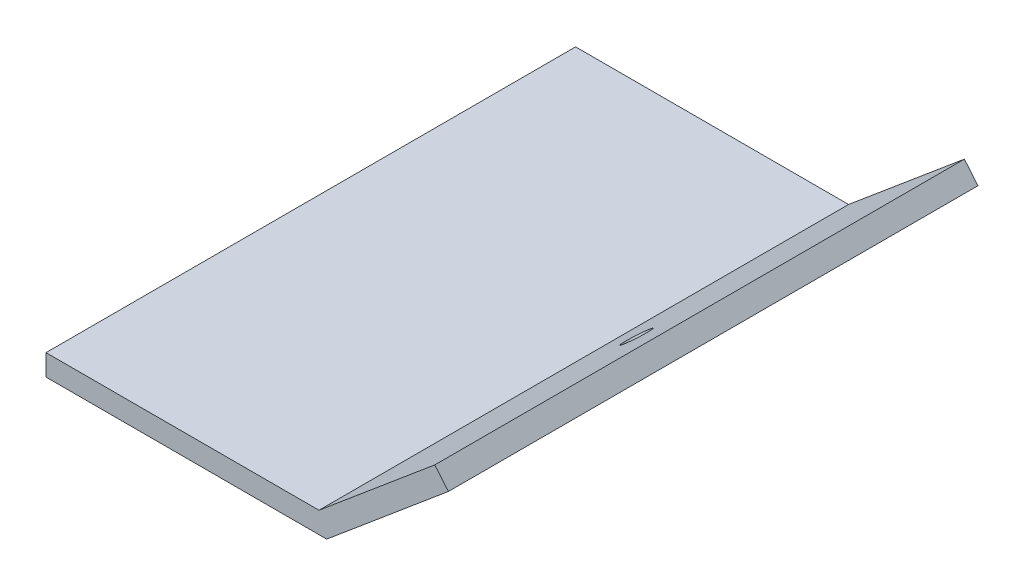
ISO-10303-21;
HEADER;
FILE_DESCRIPTION(('STEP AP214'),'2;1');
FILE_NAME('part.step','',(''),(''),'','','');
FILE_SCHEMA(('AUTOMOTIVE_DESIGN { 1 0 10303 214 1 1 1 1 }'));
ENDSEC;
DATA;
#1=APPLICATION_CONTEXT('core data for automotive mechanical design processes');
#2=APPLICATION_PROTOCOL_DEFINITION('international standard','automotive_design',2000,#1);
#3=PRODUCT_CONTEXT('',#1,'mechanical');
#4=PRODUCT('Part','Part','',(#3));
#5=PRODUCT_RELATED_PRODUCT_CATEGORY('part','',(#4));
#6=PRODUCT_DEFINITION_FORMATION('','',#4);
#7=PRODUCT_DEFINITION_CONTEXT('part definition',#1,'design');
#8=PRODUCT_DEFINITION('design','',#6,#7);
#9=PRODUCT_DEFINITION_SHAPE('','',#8);
#10=(LENGTH_UNIT() NAMED_UNIT(*) SI_UNIT(.MILLI.,.METRE.));
#11=(NAMED_UNIT(*) PLANE_ANGLE_UNIT() SI_UNIT($,.RADIAN.));
#12=(NAMED_UNIT(*) SI_UNIT($,.STERADIAN.) SOLID_ANGLE_UNIT());
#13=UNCERTAINTY_MEASURE_WITH_UNIT(LENGTH_MEASURE(1.E-05),#10,'distance_accuracy_value','');
#14=(GEOMETRIC_REPRESENTATION_CONTEXT(3) GLOBAL_UNCERTAINTY_ASSIGNED_CONTEXT((#13)) GLOBAL_UNIT_ASSIGNED_CONTEXT((#10,
#11,#12)) REPRESENTATION_CONTEXT('',''));
#15=CARTESIAN_POINT('',(0.,0.,0.));
#16=DIRECTION('',(0.,0.,1.));
#17=DIRECTION('',(1.,0.,0.));
#18=AXIS2_PLACEMENT_3D('',#15,#16,#17);
#19=CARTESIAN_POINT('',(0.,-2.,50.));
#20=DIRECTION('',(1.,0.,0.));
#21=DIRECTION('',(0.,0.,-1.));
#22=AXIS2_PLACEMENT_3D('',#19,#20,#21);
#23=PLANE('',#22);
#24=DIRECTION('',(0.,-1.,0.));
#25=VECTOR('',#24,1.);
#26=CARTESIAN_POINT('',(0.,-2.,0.));
#27=LINE('',#26,#25);
#28=CARTESIAN_POINT('',(0.,0.,0.));
#29=VERTEX_POINT('',#28);
#30=CARTESIAN_POINT('',(0.,-2.,0.));
#31=VERTEX_POINT('',#30);
#32=EDGE_CURVE('E132',#29,#31,#27,.T.);
#33=ORIENTED_EDGE('',*,*,#32,.T.);
#34=DIRECTION('',(0.,0.,-1.));
#35=VECTOR('',#34,1.);
#36=CARTESIAN_POINT('',(0.,-2.,50.));
#37=LINE('',#36,#35);
#38=CARTESIAN_POINT('',(0.,-2.,50.));
#39=VERTEX_POINT('',#38);
#40=EDGE_CURVE('E13',#39,#31,#37,.T.);
#41=ORIENTED_EDGE('',*,*,#40,.F.);
#42=DIRECTION('',(0.,-1.,0.));
#43=VECTOR('',#42,1.);
#44=CARTESIAN_POINT('',(0.,-2.,50.));
#45=LINE('',#44,#43);
#46=CARTESIAN_POINT('',(0.,0.,50.));
#47=VERTEX_POINT('',#46);
#48=EDGE_CURVE('E142',#47,#39,#45,.T.);
#49=ORIENTED_EDGE('',*,*,#48,.F.);
#50=DIRECTION('',(0.,0.,-1.));
#51=VECTOR('',#50,1.);
#52=CARTESIAN_POINT('',(0.,0.,50.));
#53=LINE('',#52,#51);
#54=EDGE_CURVE('E128',#47,#29,#53,.T.);
#55=ORIENTED_EDGE('',*,*,#54,.T.);
#56=EDGE_LOOP('',(#33,#41,#49,#55));
#57=FACE_BOUND('',#56,.T.);
#58=ADVANCED_FACE('F47',(#57),#23,.F.);
#59=CARTESIAN_POINT('',(26.5,-2.,50.));
#60=DIRECTION('',(0.,1.,0.));
#61=DIRECTION('',(-1.,0.,0.));
#62=AXIS2_PLACEMENT_3D('',#59,#60,#61);
#63=PLANE('',#62);
#64=DIRECTION('',(1.,0.,0.));
#65=VECTOR('',#64,1.);
#66=CARTESIAN_POINT('',(26.5,-2.,0.));
#67=LINE('',#66,#65);
#68=CARTESIAN_POINT('',(26.5,-2.,0.));
#69=VERTEX_POINT('',#68);
#70=EDGE_CURVE('E135',#31,#69,#67,.T.);
#71=ORIENTED_EDGE('',*,*,#70,.T.);
#72=DIRECTION('',(0.,0.,-1.));
#73=VECTOR('',#72,1.);
#74=CARTESIAN_POINT('',(26.5,-2.,50.));
#75=LINE('',#74,#73);
#76=CARTESIAN_POINT('',(26.5,-2.,50.));
#77=VERTEX_POINT('',#76);
#78=EDGE_CURVE('E56',#77,#69,#75,.T.);
#79=ORIENTED_EDGE('',*,*,#78,.F.);
#80=DIRECTION('',(1.,0.,0.));
#81=VECTOR('',#80,1.);
#82=CARTESIAN_POINT('',(26.5,-2.,50.));
#83=LINE('',#82,#81);
#84=EDGE_CURVE('E101',#39,#77,#83,.T.);
#85=ORIENTED_EDGE('',*,*,#84,.F.);
#86=ORIENTED_EDGE('',*,*,#40,.T.);
#87=EDGE_LOOP('',(#71,#79,#85,#86));
#88=FACE_BOUND('',#87,.T.);
#89=ADVANCED_FACE('F168',(#88),#63,.F.);
#90=CARTESIAN_POINT('',(37.9906666467847,7.64181414529811,50.));
#91=DIRECTION('',(-0.64278760968654,0.766044443118977,0.));
#92=DIRECTION('',(-0.766044443118977,-0.64278760968654,0.));
#93=AXIS2_PLACEMENT_3D('',#90,#91,#92);
#94=PLANE('',#93);
#95=CARTESIAN_POINT('',(32.036923631114,2.64603057672456,25.));
#96=DIRECTION('',(-0.64278760968654,0.766044443118977,0.));
#97=DIRECTION('',(-0.766044443118977,-0.64278760968654,0.));
#98=AXIS2_PLACEMENT_3D('',#95,#96,#97);
#99=CIRCLE('',#98,1.24999999999999);
#100=CARTESIAN_POINT('',(31.0793680772153,1.84254606461639,25.));
#101=VERTEX_POINT('',#100);
#102=EDGE_CURVE('E50',#101,#101,#99,.T.);
#103=ORIENTED_EDGE('',*,*,#102,.T.);
#104=EDGE_LOOP('',(#103));
#105=FACE_BOUND('',#104,.T.);
#106=DIRECTION('',(0.766044443118977,0.64278760968654,0.));
#107=VECTOR('',#106,1.);
#108=CARTESIAN_POINT('',(37.9906666467847,7.64181414529811,0.));
#109=LINE('',#108,#107);
#110=CARTESIAN_POINT('',(37.9906666467847,7.64181414529811,0.));
#111=VERTEX_POINT('',#110);
#112=EDGE_CURVE('E137',#69,#111,#109,.T.);
#113=ORIENTED_EDGE('',*,*,#112,.T.);
#114=DIRECTION('',(0.,0.,-1.));
#115=VECTOR('',#114,1.);
#116=CARTESIAN_POINT('',(37.9906666467847,7.64181414529811,50.));
#117=LINE('',#116,#115);
#118=CARTESIAN_POINT('',(37.9906666467847,7.64181414529811,50.));
#119=VERTEX_POINT('',#118);
#120=EDGE_CURVE('E123',#119,#111,#117,.T.);
#121=ORIENTED_EDGE('',*,*,#120,.F.);
#122=DIRECTION('',(0.766044443118977,0.64278760968654,0.));
#123=VECTOR('',#122,1.);
#124=CARTESIAN_POINT('',(37.9906666467847,7.64181414529811,50.));
#125=LINE('',#124,#123);
#126=EDGE_CURVE('E114',#77,#119,#125,.T.);
#127=ORIENTED_EDGE('',*,*,#126,.F.);
#128=ORIENTED_EDGE('',*,*,#78,.T.);
#129=EDGE_LOOP('',(#113,#121,#127,#128));
#130=FACE_BOUND('',#129,.T.);
#131=ADVANCED_FACE('F149',(#105,#130),#94,.F.);
#132=CARTESIAN_POINT('',(36.7050914274116,9.17390303153606,50.));
#133=DIRECTION('',(-0.766044443118978,-0.642787609686539,0.));
#134=DIRECTION('',(0.642787609686539,-0.766044443118978,0.));
#135=AXIS2_PLACEMENT_3D('',#132,#133,#134);
#136=PLANE('',#135);
#137=DIRECTION('',(-0.642787609686539,0.766044443118978,0.));
#138=VECTOR('',#137,1.);
#139=CARTESIAN_POINT('',(36.7050914274116,9.17390303153606,0.));
#140=LINE('',#139,#138);
#141=CARTESIAN_POINT('',(36.7050914274116,9.17390303153606,0.));
#142=VERTEX_POINT('',#141);
#143=EDGE_CURVE('E122',#111,#142,#140,.T.);
#144=ORIENTED_EDGE('',*,*,#143,.T.);
#145=DIRECTION('',(0.,0.,-1.));
#146=VECTOR('',#145,1.);
#147=CARTESIAN_POINT('',(36.7050914274116,9.17390303153606,50.));
#148=LINE('',#147,#146);
#149=CARTESIAN_POINT('',(36.7050914274116,9.17390303153606,50.));
#150=VERTEX_POINT('',#149);
#151=EDGE_CURVE('E119',#150,#142,#148,.T.);
#152=ORIENTED_EDGE('',*,*,#151,.F.);
#153=DIRECTION('',(-0.642787609686539,0.766044443118978,0.));
#154=VECTOR('',#153,1.);
#155=CARTESIAN_POINT('',(36.7050914274116,9.17390303153606,50.));
#156=LINE('',#155,#154);
#157=EDGE_CURVE('E108',#119,#150,#156,.T.);
#158=ORIENTED_EDGE('',*,*,#157,.F.);
#159=ORIENTED_EDGE('',*,*,#120,.T.);
#160=EDGE_LOOP('',(#144,#152,#158,#159));
#161=FACE_BOUND('',#160,.T.);
#162=ADVANCED_FACE('F120',(#161),#136,.F.);
#163=CARTESIAN_POINT('',(25.7720595314676,0.,50.));
#164=DIRECTION('',(0.64278760968654,-0.766044443118977,0.));
#165=DIRECTION('',(0.766044443118977,0.64278760968654,0.));
#166=AXIS2_PLACEMENT_3D('',#163,#164,#165);
#167=PLANE('',#166);
#168=CARTESIAN_POINT('',(30.7513484117409,4.17811946296251,25.));
#169=DIRECTION('',(-0.64278760968654,0.766044443118977,0.));
#170=DIRECTION('',(-0.766044443118977,-0.64278760968654,0.));
#171=AXIS2_PLACEMENT_3D('',#168,#169,#170);
#172=CIRCLE('',#171,1.24999999999999);
#173=CARTESIAN_POINT('',(29.7937928578422,3.37463495085434,25.));
#174=VERTEX_POINT('',#173);
#175=EDGE_CURVE('E225',#174,#174,#172,.T.);
#176=ORIENTED_EDGE('',*,*,#175,.F.);
#177=EDGE_LOOP('',(#176));
#178=FACE_BOUND('',#177,.T.);
#179=DIRECTION('',(-0.766044443118977,-0.64278760968654,0.));
#180=VECTOR('',#179,1.);
#181=CARTESIAN_POINT('',(25.7720595314676,0.,0.));
#182=LINE('',#181,#180);
#183=CARTESIAN_POINT('',(25.7720595314676,0.,0.));
#184=VERTEX_POINT('',#183);
#185=EDGE_CURVE('E87',#142,#184,#182,.T.);
#186=ORIENTED_EDGE('',*,*,#185,.T.);
#187=DIRECTION('',(0.,0.,-1.));
#188=VECTOR('',#187,1.);
#189=CARTESIAN_POINT('',(25.7720595314676,0.,50.));
#190=LINE('',#189,#188);
#191=CARTESIAN_POINT('',(25.7720595314676,0.,50.));
#192=VERTEX_POINT('',#191);
#193=EDGE_CURVE('E124',#192,#184,#190,.T.);
#194=ORIENTED_EDGE('',*,*,#193,.F.);
#195=DIRECTION('',(-0.766044443118977,-0.64278760968654,0.));
#196=VECTOR('',#195,1.);
#197=CARTESIAN_POINT('',(25.7720595314676,0.,50.));
#198=LINE('',#197,#196);
#199=EDGE_CURVE('E112',#150,#192,#198,.T.);
#200=ORIENTED_EDGE('',*,*,#199,.F.);
#201=ORIENTED_EDGE('',*,*,#151,.T.);
#202=EDGE_LOOP('',(#186,#194,#200,#201));
#203=FACE_BOUND('',#202,.T.);
#204=ADVANCED_FACE('F126',(#178,#203),#167,.F.);
#205=CARTESIAN_POINT('',(0.,0.,50.));
#206=DIRECTION('',(0.,-1.,0.));
#207=DIRECTION('',(1.,0.,0.));
#208=AXIS2_PLACEMENT_3D('',#205,#206,#207);
#209=PLANE('',#208);
#210=DIRECTION('',(-1.,0.,0.));
#211=VECTOR('',#210,1.);
#212=CARTESIAN_POINT('',(0.,0.,0.));
#213=LINE('',#212,#211);
#214=EDGE_CURVE('E93',#184,#29,#213,.T.);
#215=ORIENTED_EDGE('',*,*,#214,.T.);
#216=ORIENTED_EDGE('',*,*,#54,.F.);
#217=DIRECTION('',(-1.,0.,0.));
#218=VECTOR('',#217,1.);
#219=CARTESIAN_POINT('',(0.,0.,50.));
#220=LINE('',#219,#218);
#221=EDGE_CURVE('E64',#192,#47,#220,.T.);
#222=ORIENTED_EDGE('',*,*,#221,.F.);
#223=ORIENTED_EDGE('',*,*,#193,.T.);
#224=EDGE_LOOP('',(#215,#216,#222,#223));
#225=FACE_BOUND('',#224,.T.);
#226=ADVANCED_FACE('F156',(#225),#209,.F.);
#227=CARTESIAN_POINT('',(0.,0.,50.));
#228=DIRECTION('',(0.,0.,-1.));
#229=DIRECTION('',(-1.,0.,0.));
#230=AXIS2_PLACEMENT_3D('',#227,#228,#229);
#231=PLANE('',#230);
#232=ORIENTED_EDGE('',*,*,#48,.T.);
#233=ORIENTED_EDGE('',*,*,#84,.T.);
#234=ORIENTED_EDGE('',*,*,#126,.T.);
#235=ORIENTED_EDGE('',*,*,#157,.T.);
#236=ORIENTED_EDGE('',*,*,#199,.T.);
#237=ORIENTED_EDGE('',*,*,#221,.T.);
#238=EDGE_LOOP('',(#232,#233,#234,#235,#236,#237));
#239=FACE_BOUND('',#238,.T.);
#240=ADVANCED_FACE('F110',(#239),#231,.F.);
#241=CARTESIAN_POINT('',(0.,0.,0.));
#242=DIRECTION('',(0.,0.,-1.));
#243=DIRECTION('',(-1.,0.,0.));
#244=AXIS2_PLACEMENT_3D('',#241,#242,#243);
#245=PLANE('',#244);
#246=ORIENTED_EDGE('',*,*,#32,.F.);
#247=ORIENTED_EDGE('',*,*,#214,.F.);
#248=ORIENTED_EDGE('',*,*,#185,.F.);
#249=ORIENTED_EDGE('',*,*,#143,.F.);
#250=ORIENTED_EDGE('',*,*,#112,.F.);
#251=ORIENTED_EDGE('',*,*,#70,.F.);
#252=EDGE_LOOP('',(#246,#247,#248,#249,#250,#251));
#253=FACE_BOUND('',#252,.T.);
#254=ADVANCED_FACE('F152',(#253),#245,.T.);
#255=CARTESIAN_POINT('',(30.7513484117409,4.17811946296251,25.));
#256=DIRECTION('',(-0.64278760968654,0.766044443118977,0.));
#257=DIRECTION('',(-0.766044443118977,-0.64278760968654,0.));
#258=AXIS2_PLACEMENT_3D('',#255,#256,#257);
#259=CYLINDRICAL_SURFACE('',#258,1.24999999999999);
#260=ORIENTED_EDGE('',*,*,#175,.T.);
#261=EDGE_LOOP('',(#260));
#262=FACE_BOUND('',#261,.T.);
#263=ORIENTED_EDGE('',*,*,#102,.F.);
#264=EDGE_LOOP('',(#263));
#265=FACE_BOUND('',#264,.T.);
#266=ADVANCED_FACE('F196',(#262,#265),#259,.F.);
#267=CLOSED_SHELL('',(#58,#89,#131,#162,#204,#226,#240,#254,#266));
#268=MANIFOLD_SOLID_BREP('B2',#267);
#269=ADVANCED_BREP_SHAPE_REPRESENTATION('',(#18,#268),#14);
#270=SHAPE_DEFINITION_REPRESENTATION(#9,#269);
ENDSEC;
END-ISO-10303-21;
